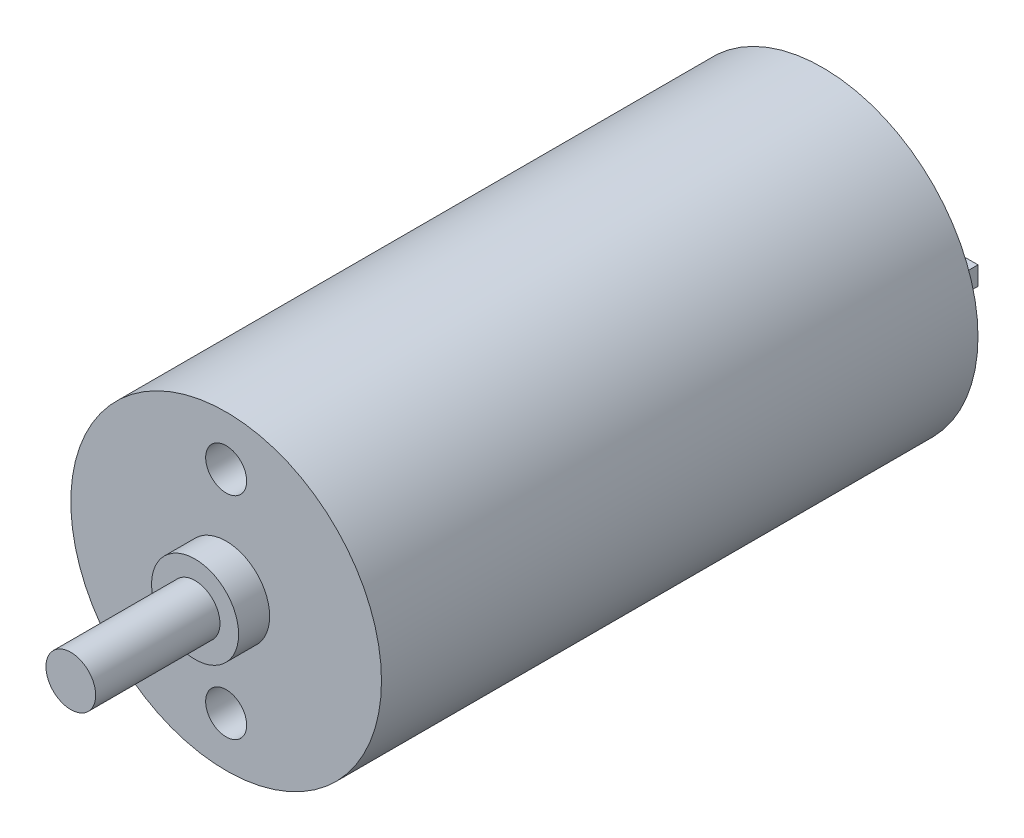
ISO-10303-21;
HEADER;
FILE_DESCRIPTION(('STEP AP214'),'2;1');
FILE_NAME('part.step','',(''),(''),'','','');
FILE_SCHEMA(('AUTOMOTIVE_DESIGN { 1 0 10303 214 1 1 1 1 }'));
ENDSEC;
DATA;
#1=APPLICATION_CONTEXT('core data for automotive mechanical design processes');
#2=APPLICATION_PROTOCOL_DEFINITION('international standard','automotive_design',2000,#1);
#3=PRODUCT_CONTEXT('',#1,'mechanical');
#4=PRODUCT('Part','Part','',(#3));
#5=PRODUCT_RELATED_PRODUCT_CATEGORY('part','',(#4));
#6=PRODUCT_DEFINITION_FORMATION('','',#4);
#7=PRODUCT_DEFINITION_CONTEXT('part definition',#1,'design');
#8=PRODUCT_DEFINITION('design','',#6,#7);
#9=PRODUCT_DEFINITION_SHAPE('','',#8);
#10=(LENGTH_UNIT() NAMED_UNIT(*) SI_UNIT(.MILLI.,.METRE.));
#11=(NAMED_UNIT(*) PLANE_ANGLE_UNIT() SI_UNIT($,.RADIAN.));
#12=(NAMED_UNIT(*) SI_UNIT($,.STERADIAN.) SOLID_ANGLE_UNIT());
#13=UNCERTAINTY_MEASURE_WITH_UNIT(LENGTH_MEASURE(1.E-05),#10,'distance_accuracy_value','');
#14=(GEOMETRIC_REPRESENTATION_CONTEXT(3) GLOBAL_UNCERTAINTY_ASSIGNED_CONTEXT((#13)) GLOBAL_UNIT_ASSIGNED_CONTEXT((#10,
#11,#12)) REPRESENTATION_CONTEXT('',''));
#15=CARTESIAN_POINT('',(0.,0.,0.));
#16=DIRECTION('',(0.,0.,1.));
#17=DIRECTION('',(1.,0.,0.));
#18=AXIS2_PLACEMENT_3D('',#15,#16,#17);
#19=CARTESIAN_POINT('',(0.,0.,0.));
#20=DIRECTION('',(0.,0.,1.));
#21=DIRECTION('',(1.,0.,0.));
#22=AXIS2_PLACEMENT_3D('',#19,#20,#21);
#23=PLANE('',#22);
#24=DIRECTION('',(0.,-1.,0.));
#25=VECTOR('',#24,1.);
#26=CARTESIAN_POINT('',(8.5,1.,0.));
#27=LINE('',#26,#25);
#28=CARTESIAN_POINT('',(8.5,1.,0.));
#29=VERTEX_POINT('',#28);
#30=CARTESIAN_POINT('',(8.5,-0.5,0.));
#31=VERTEX_POINT('',#30);
#32=EDGE_CURVE('E119',#29,#31,#27,.T.);
#33=ORIENTED_EDGE('',*,*,#32,.F.);
#34=DIRECTION('',(1.,0.,0.));
#35=VECTOR('',#34,1.);
#36=CARTESIAN_POINT('',(8.5,1.,0.));
#37=LINE('',#36,#35);
#38=CARTESIAN_POINT('',(4.5,1.,0.));
#39=VERTEX_POINT('',#38);
#40=EDGE_CURVE('E132',#39,#29,#37,.T.);
#41=ORIENTED_EDGE('',*,*,#40,.F.);
#42=DIRECTION('',(0.,1.,0.));
#43=VECTOR('',#42,1.);
#44=CARTESIAN_POINT('',(4.5,1.,0.));
#45=LINE('',#44,#43);
#46=CARTESIAN_POINT('',(4.5,-0.5,0.));
#47=VERTEX_POINT('',#46);
#48=EDGE_CURVE('E141',#47,#39,#45,.T.);
#49=ORIENTED_EDGE('',*,*,#48,.F.);
#50=DIRECTION('',(-1.,0.,0.));
#51=VECTOR('',#50,1.);
#52=CARTESIAN_POINT('',(8.5,-0.5,0.));
#53=LINE('',#52,#51);
#54=EDGE_CURVE('E122',#31,#47,#53,.T.);
#55=ORIENTED_EDGE('',*,*,#54,.F.);
#56=EDGE_LOOP('',(#33,#41,#49,#55));
#57=FACE_BOUND('',#56,.T.);
#58=CARTESIAN_POINT('',(0.,0.,0.));
#59=DIRECTION('',(0.,0.,1.));
#60=DIRECTION('',(1.,0.,0.));
#61=AXIS2_PLACEMENT_3D('',#58,#59,#60);
#62=CIRCLE('',#61,12.5);
#63=CARTESIAN_POINT('',(12.5,0.,0.));
#64=VERTEX_POINT('',#63);
#65=EDGE_CURVE('E37',#64,#64,#62,.T.);
#66=ORIENTED_EDGE('',*,*,#65,.F.);
#67=EDGE_LOOP('',(#66));
#68=FACE_BOUND('',#67,.T.);
#69=DIRECTION('',(0.,-1.,0.));
#70=VECTOR('',#69,1.);
#71=CARTESIAN_POINT('',(-4.5,1.,0.));
#72=LINE('',#71,#70);
#73=CARTESIAN_POINT('',(-4.5,1.,0.));
#74=VERTEX_POINT('',#73);
#75=CARTESIAN_POINT('',(-4.5,-0.5,0.));
#76=VERTEX_POINT('',#75);
#77=EDGE_CURVE('E118',#74,#76,#72,.T.);
#78=ORIENTED_EDGE('',*,*,#77,.F.);
#79=DIRECTION('',(1.,0.,0.));
#80=VECTOR('',#79,1.);
#81=CARTESIAN_POINT('',(-4.5,1.,0.));
#82=LINE('',#81,#80);
#83=CARTESIAN_POINT('',(-8.5,1.,0.));
#84=VERTEX_POINT('',#83);
#85=EDGE_CURVE('E115',#84,#74,#82,.T.);
#86=ORIENTED_EDGE('',*,*,#85,.F.);
#87=DIRECTION('',(0.,1.,0.));
#88=VECTOR('',#87,1.);
#89=CARTESIAN_POINT('',(-8.5,1.,0.));
#90=LINE('',#89,#88);
#91=CARTESIAN_POINT('',(-8.5,-0.5,0.));
#92=VERTEX_POINT('',#91);
#93=EDGE_CURVE('E53',#92,#84,#90,.T.);
#94=ORIENTED_EDGE('',*,*,#93,.F.);
#95=DIRECTION('',(-1.,0.,0.));
#96=VECTOR('',#95,1.);
#97=CARTESIAN_POINT('',(-4.5,-0.5,0.));
#98=LINE('',#97,#96);
#99=EDGE_CURVE('E48',#76,#92,#98,.T.);
#100=ORIENTED_EDGE('',*,*,#99,.F.);
#101=EDGE_LOOP('',(#78,#86,#94,#100));
#102=FACE_BOUND('',#101,.T.);
#103=ADVANCED_FACE('F33',(#57,#68,#102),#23,.F.);
#104=CARTESIAN_POINT('',(0.,0.,48.));
#105=DIRECTION('',(0.,0.,-1.));
#106=DIRECTION('',(-1.,0.,0.));
#107=AXIS2_PLACEMENT_3D('',#104,#105,#106);
#108=CYLINDRICAL_SURFACE('',#107,12.5);
#109=CARTESIAN_POINT('',(0.,0.,48.));
#110=DIRECTION('',(0.,0.,1.));
#111=DIRECTION('',(1.,0.,0.));
#112=AXIS2_PLACEMENT_3D('',#109,#110,#111);
#113=CIRCLE('',#112,12.5);
#114=CARTESIAN_POINT('',(12.5,0.,48.));
#115=VERTEX_POINT('',#114);
#116=EDGE_CURVE('E11',#115,#115,#113,.T.);
#117=ORIENTED_EDGE('',*,*,#116,.F.);
#118=EDGE_LOOP('',(#117));
#119=FACE_BOUND('',#118,.T.);
#120=ORIENTED_EDGE('',*,*,#65,.T.);
#121=EDGE_LOOP('',(#120));
#122=FACE_BOUND('',#121,.T.);
#123=ADVANCED_FACE('F35',(#119,#122),#108,.T.);
#124=CARTESIAN_POINT('',(0.,0.,48.));
#125=DIRECTION('',(0.,0.,1.));
#126=DIRECTION('',(1.,0.,0.));
#127=AXIS2_PLACEMENT_3D('',#124,#125,#126);
#128=PLANE('',#127);
#129=CARTESIAN_POINT('',(0.,-8.5,48.));
#130=DIRECTION('',(0.,0.,1.));
#131=DIRECTION('',(1.,0.,0.));
#132=AXIS2_PLACEMENT_3D('',#129,#130,#131);
#133=CIRCLE('',#132,1.65);
#134=CARTESIAN_POINT('',(1.65,-8.5,48.));
#135=VERTEX_POINT('',#134);
#136=EDGE_CURVE('E207',#135,#135,#133,.T.);
#137=ORIENTED_EDGE('',*,*,#136,.F.);
#138=EDGE_LOOP('',(#137));
#139=FACE_BOUND('',#138,.T.);
#140=CARTESIAN_POINT('',(0.,8.5,48.));
#141=DIRECTION('',(0.,0.,1.));
#142=DIRECTION('',(1.,0.,0.));
#143=AXIS2_PLACEMENT_3D('',#140,#141,#142);
#144=CIRCLE('',#143,1.65);
#145=CARTESIAN_POINT('',(1.65,8.5,48.));
#146=VERTEX_POINT('',#145);
#147=EDGE_CURVE('E201',#146,#146,#144,.T.);
#148=ORIENTED_EDGE('',*,*,#147,.F.);
#149=EDGE_LOOP('',(#148));
#150=FACE_BOUND('',#149,.T.);
#151=CARTESIAN_POINT('',(0.,0.,48.));
#152=DIRECTION('',(0.,0.,1.));
#153=DIRECTION('',(1.,0.,0.));
#154=AXIS2_PLACEMENT_3D('',#151,#152,#153);
#155=CIRCLE('',#154,3.5);
#156=CARTESIAN_POINT('',(3.5,0.,48.));
#157=VERTEX_POINT('',#156);
#158=EDGE_CURVE('E161',#157,#157,#155,.T.);
#159=ORIENTED_EDGE('',*,*,#158,.F.);
#160=EDGE_LOOP('',(#159));
#161=FACE_BOUND('',#160,.T.);
#162=ORIENTED_EDGE('',*,*,#116,.T.);
#163=EDGE_LOOP('',(#162));
#164=FACE_BOUND('',#163,.T.);
#165=ADVANCED_FACE('F172',(#139,#150,#161,#164),#128,.T.);
#166=CARTESIAN_POINT('',(0.,0.,50.5));
#167=DIRECTION('',(0.,0.,-1.));
#168=DIRECTION('',(-1.,0.,0.));
#169=AXIS2_PLACEMENT_3D('',#166,#167,#168);
#170=CYLINDRICAL_SURFACE('',#169,3.5);
#171=CARTESIAN_POINT('',(0.,0.,50.5));
#172=DIRECTION('',(0.,0.,1.));
#173=DIRECTION('',(1.,0.,0.));
#174=AXIS2_PLACEMENT_3D('',#171,#172,#173);
#175=CIRCLE('',#174,3.5);
#176=CARTESIAN_POINT('',(3.5,0.,50.5));
#177=VERTEX_POINT('',#176);
#178=EDGE_CURVE('E164',#177,#177,#175,.T.);
#179=ORIENTED_EDGE('',*,*,#178,.F.);
#180=EDGE_LOOP('',(#179));
#181=FACE_BOUND('',#180,.T.);
#182=ORIENTED_EDGE('',*,*,#158,.T.);
#183=EDGE_LOOP('',(#182));
#184=FACE_BOUND('',#183,.T.);
#185=ADVANCED_FACE('F170',(#181,#184),#170,.T.);
#186=CARTESIAN_POINT('',(0.,0.,50.5));
#187=DIRECTION('',(0.,0.,1.));
#188=DIRECTION('',(1.,0.,0.));
#189=AXIS2_PLACEMENT_3D('',#186,#187,#188);
#190=PLANE('',#189);
#191=CARTESIAN_POINT('',(0.,0.,50.5));
#192=DIRECTION('',(0.,0.,1.));
#193=DIRECTION('',(1.,0.,0.));
#194=AXIS2_PLACEMENT_3D('',#191,#192,#193);
#195=CIRCLE('',#194,2.);
#196=CARTESIAN_POINT('',(2.,0.,50.5));
#197=VERTEX_POINT('',#196);
#198=EDGE_CURVE('E157',#197,#197,#195,.T.);
#199=ORIENTED_EDGE('',*,*,#198,.F.);
#200=EDGE_LOOP('',(#199));
#201=FACE_BOUND('',#200,.T.);
#202=ORIENTED_EDGE('',*,*,#178,.T.);
#203=EDGE_LOOP('',(#202));
#204=FACE_BOUND('',#203,.T.);
#205=ADVANCED_FACE('F274',(#201,#204),#190,.T.);
#206=CARTESIAN_POINT('',(0.,0.,60.5));
#207=DIRECTION('',(0.,0.,-1.));
#208=DIRECTION('',(-1.,0.,0.));
#209=AXIS2_PLACEMENT_3D('',#206,#207,#208);
#210=CYLINDRICAL_SURFACE('',#209,2.);
#211=CARTESIAN_POINT('',(0.,0.,60.5));
#212=DIRECTION('',(0.,0.,1.));
#213=DIRECTION('',(1.,0.,0.));
#214=AXIS2_PLACEMENT_3D('',#211,#212,#213);
#215=CIRCLE('',#214,2.);
#216=CARTESIAN_POINT('',(2.,0.,60.5));
#217=VERTEX_POINT('',#216);
#218=EDGE_CURVE('E158',#217,#217,#215,.T.);
#219=ORIENTED_EDGE('',*,*,#218,.F.);
#220=EDGE_LOOP('',(#219));
#221=FACE_BOUND('',#220,.T.);
#222=ORIENTED_EDGE('',*,*,#198,.T.);
#223=EDGE_LOOP('',(#222));
#224=FACE_BOUND('',#223,.T.);
#225=ADVANCED_FACE('F270',(#221,#224),#210,.T.);
#226=CARTESIAN_POINT('',(0.,0.,60.5));
#227=DIRECTION('',(0.,0.,1.));
#228=DIRECTION('',(1.,0.,0.));
#229=AXIS2_PLACEMENT_3D('',#226,#227,#228);
#230=PLANE('',#229);
#231=ORIENTED_EDGE('',*,*,#218,.T.);
#232=EDGE_LOOP('',(#231));
#233=FACE_BOUND('',#232,.T.);
#234=ADVANCED_FACE('F266',(#233),#230,.T.);
#235=CARTESIAN_POINT('',(8.5,1.,-4.));
#236=DIRECTION('',(-1.,0.,0.));
#237=DIRECTION('',(0.,0.,1.));
#238=AXIS2_PLACEMENT_3D('',#235,#236,#237);
#239=PLANE('',#238);
#240=ORIENTED_EDGE('',*,*,#32,.T.);
#241=DIRECTION('',(0.,0.,1.));
#242=VECTOR('',#241,1.);
#243=CARTESIAN_POINT('',(8.5,-0.5,-4.));
#244=LINE('',#243,#242);
#245=CARTESIAN_POINT('',(8.5,-0.5,-4.));
#246=VERTEX_POINT('',#245);
#247=EDGE_CURVE('E154',#246,#31,#244,.T.);
#248=ORIENTED_EDGE('',*,*,#247,.F.);
#249=DIRECTION('',(0.,-1.,0.));
#250=VECTOR('',#249,1.);
#251=CARTESIAN_POINT('',(8.5,1.,-4.));
#252=LINE('',#251,#250);
#253=CARTESIAN_POINT('',(8.5,1.,-4.));
#254=VERTEX_POINT('',#253);
#255=EDGE_CURVE('E128',#254,#246,#252,.T.);
#256=ORIENTED_EDGE('',*,*,#255,.F.);
#257=DIRECTION('',(0.,0.,1.));
#258=VECTOR('',#257,1.);
#259=CARTESIAN_POINT('',(8.5,1.,-4.));
#260=LINE('',#259,#258);
#261=EDGE_CURVE('E137',#254,#29,#260,.T.);
#262=ORIENTED_EDGE('',*,*,#261,.T.);
#263=EDGE_LOOP('',(#240,#248,#256,#262));
#264=FACE_BOUND('',#263,.T.);
#265=ADVANCED_FACE('F262',(#264),#239,.F.);
#266=CARTESIAN_POINT('',(8.5,-0.5,-4.));
#267=DIRECTION('',(0.,1.,0.));
#268=DIRECTION('',(0.,0.,1.));
#269=AXIS2_PLACEMENT_3D('',#266,#267,#268);
#270=PLANE('',#269);
#271=ORIENTED_EDGE('',*,*,#54,.T.);
#272=DIRECTION('',(0.,0.,1.));
#273=VECTOR('',#272,1.);
#274=CARTESIAN_POINT('',(4.5,-0.5,-4.));
#275=LINE('',#274,#273);
#276=CARTESIAN_POINT('',(4.5,-0.5,-4.));
#277=VERTEX_POINT('',#276);
#278=EDGE_CURVE('E151',#277,#47,#275,.T.);
#279=ORIENTED_EDGE('',*,*,#278,.F.);
#280=DIRECTION('',(-1.,0.,0.));
#281=VECTOR('',#280,1.);
#282=CARTESIAN_POINT('',(8.5,-0.5,-4.));
#283=LINE('',#282,#281);
#284=EDGE_CURVE('E131',#246,#277,#283,.T.);
#285=ORIENTED_EDGE('',*,*,#284,.F.);
#286=ORIENTED_EDGE('',*,*,#247,.T.);
#287=EDGE_LOOP('',(#271,#279,#285,#286));
#288=FACE_BOUND('',#287,.T.);
#289=ADVANCED_FACE('F258',(#288),#270,.F.);
#290=CARTESIAN_POINT('',(4.5,1.,-4.));
#291=DIRECTION('',(1.,0.,0.));
#292=DIRECTION('',(0.,0.,-1.));
#293=AXIS2_PLACEMENT_3D('',#290,#291,#292);
#294=PLANE('',#293);
#295=ORIENTED_EDGE('',*,*,#48,.T.);
#296=DIRECTION('',(0.,0.,1.));
#297=VECTOR('',#296,1.);
#298=CARTESIAN_POINT('',(4.5,1.,-4.));
#299=LINE('',#298,#297);
#300=CARTESIAN_POINT('',(4.5,1.,-4.));
#301=VERTEX_POINT('',#300);
#302=EDGE_CURVE('E148',#301,#39,#299,.T.);
#303=ORIENTED_EDGE('',*,*,#302,.F.);
#304=DIRECTION('',(0.,1.,0.));
#305=VECTOR('',#304,1.);
#306=CARTESIAN_POINT('',(4.5,1.,-4.));
#307=LINE('',#306,#305);
#308=EDGE_CURVE('E134',#277,#301,#307,.T.);
#309=ORIENTED_EDGE('',*,*,#308,.F.);
#310=ORIENTED_EDGE('',*,*,#278,.T.);
#311=EDGE_LOOP('',(#295,#303,#309,#310));
#312=FACE_BOUND('',#311,.T.);
#313=ADVANCED_FACE('F254',(#312),#294,.F.);
#314=CARTESIAN_POINT('',(8.5,1.,-4.));
#315=DIRECTION('',(0.,-1.,0.));
#316=DIRECTION('',(0.,0.,-1.));
#317=AXIS2_PLACEMENT_3D('',#314,#315,#316);
#318=PLANE('',#317);
#319=ORIENTED_EDGE('',*,*,#40,.T.);
#320=ORIENTED_EDGE('',*,*,#261,.F.);
#321=DIRECTION('',(1.,0.,0.));
#322=VECTOR('',#321,1.);
#323=CARTESIAN_POINT('',(8.5,1.,-4.));
#324=LINE('',#323,#322);
#325=EDGE_CURVE('E136',#301,#254,#324,.T.);
#326=ORIENTED_EDGE('',*,*,#325,.F.);
#327=ORIENTED_EDGE('',*,*,#302,.T.);
#328=EDGE_LOOP('',(#319,#320,#326,#327));
#329=FACE_BOUND('',#328,.T.);
#330=ADVANCED_FACE('F250',(#329),#318,.F.);
#331=CARTESIAN_POINT('',(0.,0.,-4.));
#332=DIRECTION('',(0.,0.,-1.));
#333=DIRECTION('',(-1.,0.,0.));
#334=AXIS2_PLACEMENT_3D('',#331,#332,#333);
#335=PLANE('',#334);
#336=ORIENTED_EDGE('',*,*,#255,.T.);
#337=ORIENTED_EDGE('',*,*,#284,.T.);
#338=ORIENTED_EDGE('',*,*,#308,.T.);
#339=ORIENTED_EDGE('',*,*,#325,.T.);
#340=EDGE_LOOP('',(#336,#337,#338,#339));
#341=FACE_BOUND('',#340,.T.);
#342=ADVANCED_FACE('F247',(#341),#335,.T.);
#343=CARTESIAN_POINT('',(-4.5,1.,-4.));
#344=DIRECTION('',(-1.,0.,0.));
#345=DIRECTION('',(0.,0.,1.));
#346=AXIS2_PLACEMENT_3D('',#343,#344,#345);
#347=PLANE('',#346);
#348=ORIENTED_EDGE('',*,*,#77,.T.);
#349=DIRECTION('',(0.,0.,1.));
#350=VECTOR('',#349,1.);
#351=CARTESIAN_POINT('',(-4.5,-0.5,-4.));
#352=LINE('',#351,#350);
#353=CARTESIAN_POINT('',(-4.5,-0.5,-4.));
#354=VERTEX_POINT('',#353);
#355=EDGE_CURVE('E99',#354,#76,#352,.T.);
#356=ORIENTED_EDGE('',*,*,#355,.F.);
#357=DIRECTION('',(0.,-1.,0.));
#358=VECTOR('',#357,1.);
#359=CARTESIAN_POINT('',(-4.5,1.,-4.));
#360=LINE('',#359,#358);
#361=CARTESIAN_POINT('',(-4.5,1.,-4.));
#362=VERTEX_POINT('',#361);
#363=EDGE_CURVE('E106',#362,#354,#360,.T.);
#364=ORIENTED_EDGE('',*,*,#363,.F.);
#365=DIRECTION('',(0.,0.,1.));
#366=VECTOR('',#365,1.);
#367=CARTESIAN_POINT('',(-4.5,1.,-4.));
#368=LINE('',#367,#366);
#369=EDGE_CURVE('E192',#362,#74,#368,.T.);
#370=ORIENTED_EDGE('',*,*,#369,.T.);
#371=EDGE_LOOP('',(#348,#356,#364,#370));
#372=FACE_BOUND('',#371,.T.);
#373=ADVANCED_FACE('F117',(#372),#347,.F.);
#374=CARTESIAN_POINT('',(-4.5,-0.5,-4.));
#375=DIRECTION('',(0.,1.,0.));
#376=DIRECTION('',(0.,0.,1.));
#377=AXIS2_PLACEMENT_3D('',#374,#375,#376);
#378=PLANE('',#377);
#379=ORIENTED_EDGE('',*,*,#99,.T.);
#380=DIRECTION('',(0.,0.,1.));
#381=VECTOR('',#380,1.);
#382=CARTESIAN_POINT('',(-8.5,-0.5,-4.));
#383=LINE('',#382,#381);
#384=CARTESIAN_POINT('',(-8.5,-0.5,-4.));
#385=VERTEX_POINT('',#384);
#386=EDGE_CURVE('E102',#385,#92,#383,.T.);
#387=ORIENTED_EDGE('',*,*,#386,.F.);
#388=DIRECTION('',(-1.,0.,0.));
#389=VECTOR('',#388,1.);
#390=CARTESIAN_POINT('',(-4.5,-0.5,-4.));
#391=LINE('',#390,#389);
#392=EDGE_CURVE('E95',#354,#385,#391,.T.);
#393=ORIENTED_EDGE('',*,*,#392,.F.);
#394=ORIENTED_EDGE('',*,*,#355,.T.);
#395=EDGE_LOOP('',(#379,#387,#393,#394));
#396=FACE_BOUND('',#395,.T.);
#397=ADVANCED_FACE('F97',(#396),#378,.F.);
#398=CARTESIAN_POINT('',(-8.5,1.,-4.));
#399=DIRECTION('',(1.,0.,0.));
#400=DIRECTION('',(0.,0.,-1.));
#401=AXIS2_PLACEMENT_3D('',#398,#399,#400);
#402=PLANE('',#401);
#403=ORIENTED_EDGE('',*,*,#93,.T.);
#404=DIRECTION('',(0.,0.,1.));
#405=VECTOR('',#404,1.);
#406=CARTESIAN_POINT('',(-8.5,1.,-4.));
#407=LINE('',#406,#405);
#408=CARTESIAN_POINT('',(-8.5,1.,-4.));
#409=VERTEX_POINT('',#408);
#410=EDGE_CURVE('E124',#409,#84,#407,.T.);
#411=ORIENTED_EDGE('',*,*,#410,.F.);
#412=DIRECTION('',(0.,1.,0.));
#413=VECTOR('',#412,1.);
#414=CARTESIAN_POINT('',(-8.5,1.,-4.));
#415=LINE('',#414,#413);
#416=EDGE_CURVE('E105',#385,#409,#415,.T.);
#417=ORIENTED_EDGE('',*,*,#416,.F.);
#418=ORIENTED_EDGE('',*,*,#386,.T.);
#419=EDGE_LOOP('',(#403,#411,#417,#418));
#420=FACE_BOUND('',#419,.T.);
#421=ADVANCED_FACE('F239',(#420),#402,.F.);
#422=CARTESIAN_POINT('',(-4.5,1.,-4.));
#423=DIRECTION('',(0.,-1.,0.));
#424=DIRECTION('',(0.,0.,-1.));
#425=AXIS2_PLACEMENT_3D('',#422,#423,#424);
#426=PLANE('',#425);
#427=ORIENTED_EDGE('',*,*,#85,.T.);
#428=ORIENTED_EDGE('',*,*,#369,.F.);
#429=DIRECTION('',(1.,0.,0.));
#430=VECTOR('',#429,1.);
#431=CARTESIAN_POINT('',(-4.5,1.,-4.));
#432=LINE('',#431,#430);
#433=EDGE_CURVE('E111',#409,#362,#432,.T.);
#434=ORIENTED_EDGE('',*,*,#433,.F.);
#435=ORIENTED_EDGE('',*,*,#410,.T.);
#436=EDGE_LOOP('',(#427,#428,#434,#435));
#437=FACE_BOUND('',#436,.T.);
#438=ADVANCED_FACE('F191',(#437),#426,.F.);
#439=CARTESIAN_POINT('',(0.,0.,-4.));
#440=DIRECTION('',(0.,0.,-1.));
#441=DIRECTION('',(-1.,0.,0.));
#442=AXIS2_PLACEMENT_3D('',#439,#440,#441);
#443=PLANE('',#442);
#444=ORIENTED_EDGE('',*,*,#363,.T.);
#445=ORIENTED_EDGE('',*,*,#392,.T.);
#446=ORIENTED_EDGE('',*,*,#416,.T.);
#447=ORIENTED_EDGE('',*,*,#433,.T.);
#448=EDGE_LOOP('',(#444,#445,#446,#447));
#449=FACE_BOUND('',#448,.T.);
#450=ADVANCED_FACE('F109',(#449),#443,.T.);
#451=CARTESIAN_POINT('',(0.,8.5,44.));
#452=DIRECTION('',(0.,0.,1.));
#453=DIRECTION('',(1.,0.,0.));
#454=AXIS2_PLACEMENT_3D('',#451,#452,#453);
#455=CYLINDRICAL_SURFACE('',#454,1.65);
#456=CARTESIAN_POINT('',(0.,8.5,44.));
#457=DIRECTION('',(0.,0.,1.));
#458=DIRECTION('',(1.,0.,0.));
#459=AXIS2_PLACEMENT_3D('',#456,#457,#458);
#460=CIRCLE('',#459,1.65);
#461=CARTESIAN_POINT('',(1.65,8.5,44.));
#462=VERTEX_POINT('',#461);
#463=EDGE_CURVE('E187',#462,#462,#460,.T.);
#464=ORIENTED_EDGE('',*,*,#463,.F.);
#465=EDGE_LOOP('',(#464));
#466=FACE_BOUND('',#465,.T.);
#467=ORIENTED_EDGE('',*,*,#147,.T.);
#468=EDGE_LOOP('',(#467));
#469=FACE_BOUND('',#468,.T.);
#470=ADVANCED_FACE('F224',(#466,#469),#455,.F.);
#471=CARTESIAN_POINT('',(0.,8.5,44.));
#472=DIRECTION('',(0.,0.,1.));
#473=DIRECTION('',(1.,0.,0.));
#474=AXIS2_PLACEMENT_3D('',#471,#472,#473);
#475=PLANE('',#474);
#476=ORIENTED_EDGE('',*,*,#463,.T.);
#477=EDGE_LOOP('',(#476));
#478=FACE_BOUND('',#477,.T.);
#479=ADVANCED_FACE('F218',(#478),#475,.T.);
#480=CARTESIAN_POINT('',(0.,-8.5,44.));
#481=DIRECTION('',(0.,0.,1.));
#482=DIRECTION('',(1.,0.,0.));
#483=AXIS2_PLACEMENT_3D('',#480,#481,#482);
#484=CYLINDRICAL_SURFACE('',#483,1.65);
#485=CARTESIAN_POINT('',(0.,-8.5,44.));
#486=DIRECTION('',(0.,0.,1.));
#487=DIRECTION('',(1.,0.,0.));
#488=AXIS2_PLACEMENT_3D('',#485,#486,#487);
#489=CIRCLE('',#488,1.65);
#490=CARTESIAN_POINT('',(1.65,-8.5,44.));
#491=VERTEX_POINT('',#490);
#492=EDGE_CURVE('E204',#491,#491,#489,.T.);
#493=ORIENTED_EDGE('',*,*,#492,.F.);
#494=EDGE_LOOP('',(#493));
#495=FACE_BOUND('',#494,.T.);
#496=ORIENTED_EDGE('',*,*,#136,.T.);
#497=EDGE_LOOP('',(#496));
#498=FACE_BOUND('',#497,.T.);
#499=ADVANCED_FACE('F215',(#495,#498),#484,.F.);
#500=CARTESIAN_POINT('',(0.,-8.5,44.));
#501=DIRECTION('',(0.,0.,1.));
#502=DIRECTION('',(1.,0.,0.));
#503=AXIS2_PLACEMENT_3D('',#500,#501,#502);
#504=PLANE('',#503);
#505=ORIENTED_EDGE('',*,*,#492,.T.);
#506=EDGE_LOOP('',(#505));
#507=FACE_BOUND('',#506,.T.);
#508=ADVANCED_FACE('F213',(#507),#504,.T.);
#509=CLOSED_SHELL('',(#103,#123,#165,#185,#205,#225,#234,#265,#289,#313,#330,#342,#373,#397,
#421,#438,#450,#470,#479,#499,#508));
#510=MANIFOLD_SOLID_BREP('B2',#509);
#511=ADVANCED_BREP_SHAPE_REPRESENTATION('',(#18,#510),#14);
#512=SHAPE_DEFINITION_REPRESENTATION(#9,#511);
ENDSEC;
END-ISO-10303-21;
